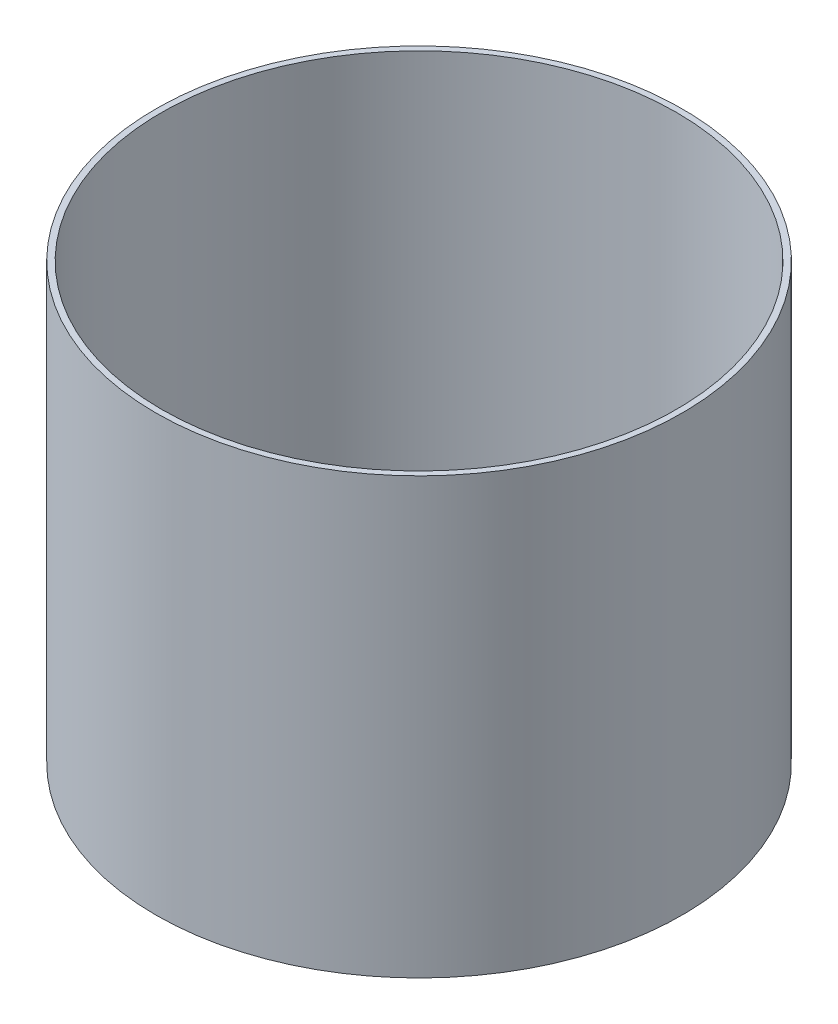
ISO-10303-21;
HEADER;
FILE_DESCRIPTION(('STEP AP214'),'2;1');
FILE_NAME('part.step','',(''),(''),'','','');
FILE_SCHEMA(('AUTOMOTIVE_DESIGN { 1 0 10303 214 1 1 1 1 }'));
ENDSEC;
DATA;
#1=APPLICATION_CONTEXT('core data for automotive mechanical design processes');
#2=APPLICATION_PROTOCOL_DEFINITION('international standard','automotive_design',2000,#1);
#3=PRODUCT_CONTEXT('',#1,'mechanical');
#4=PRODUCT('Part','Part','',(#3));
#5=PRODUCT_RELATED_PRODUCT_CATEGORY('part','',(#4));
#6=PRODUCT_DEFINITION_FORMATION('','',#4);
#7=PRODUCT_DEFINITION_CONTEXT('part definition',#1,'design');
#8=PRODUCT_DEFINITION('design','',#6,#7);
#9=PRODUCT_DEFINITION_SHAPE('','',#8);
#10=(LENGTH_UNIT() NAMED_UNIT(*) SI_UNIT(.MILLI.,.METRE.));
#11=(NAMED_UNIT(*) PLANE_ANGLE_UNIT() SI_UNIT($,.RADIAN.));
#12=(NAMED_UNIT(*) SI_UNIT($,.STERADIAN.) SOLID_ANGLE_UNIT());
#13=UNCERTAINTY_MEASURE_WITH_UNIT(LENGTH_MEASURE(1.E-05),#10,'distance_accuracy_value','');
#14=(GEOMETRIC_REPRESENTATION_CONTEXT(3) GLOBAL_UNCERTAINTY_ASSIGNED_CONTEXT((#13)) GLOBAL_UNIT_ASSIGNED_CONTEXT((#10,
#11,#12)) REPRESENTATION_CONTEXT('',''));
#15=CARTESIAN_POINT('',(0.,0.,0.));
#16=DIRECTION('',(0.,0.,1.));
#17=DIRECTION('',(1.,0.,0.));
#18=AXIS2_PLACEMENT_3D('',#15,#16,#17);
#19=CARTESIAN_POINT('',(0.,36.5,0.));
#20=DIRECTION('',(0.,1.,0.));
#21=DIRECTION('',(0.,0.,1.));
#22=AXIS2_PLACEMENT_3D('',#19,#20,#21);
#23=PLANE('',#22);
#24=CARTESIAN_POINT('',(0.,36.5,0.));
#25=DIRECTION('',(0.,1.,0.));
#26=DIRECTION('',(0.,0.,1.));
#27=AXIS2_PLACEMENT_3D('',#24,#25,#26);
#28=CIRCLE('',#27,22.1);
#29=CARTESIAN_POINT('',(0.,36.5,22.1));
#30=VERTEX_POINT('',#29);
#31=EDGE_CURVE('E10',#30,#30,#28,.T.);
#32=ORIENTED_EDGE('',*,*,#31,.T.);
#33=EDGE_LOOP('',(#32));
#34=FACE_BOUND('',#33,.T.);
#35=CARTESIAN_POINT('',(0.,36.5,0.));
#36=DIRECTION('',(0.,1.,0.));
#37=DIRECTION('',(0.,0.,1.));
#38=AXIS2_PLACEMENT_3D('',#35,#36,#37);
#39=CIRCLE('',#38,21.6);
#40=CARTESIAN_POINT('',(0.,36.5,21.6));
#41=VERTEX_POINT('',#40);
#42=EDGE_CURVE('E56',#41,#41,#39,.T.);
#43=ORIENTED_EDGE('',*,*,#42,.F.);
#44=EDGE_LOOP('',(#43));
#45=FACE_BOUND('',#44,.T.);
#46=ADVANCED_FACE('F41',(#34,#45),#23,.T.);
#47=CARTESIAN_POINT('',(0.,0.,0.));
#48=DIRECTION('',(0.,1.,0.));
#49=DIRECTION('',(0.,0.,1.));
#50=AXIS2_PLACEMENT_3D('',#47,#48,#49);
#51=PLANE('',#50);
#52=CARTESIAN_POINT('',(0.,0.,0.));
#53=DIRECTION('',(0.,1.,0.));
#54=DIRECTION('',(0.,0.,1.));
#55=AXIS2_PLACEMENT_3D('',#52,#53,#54);
#56=CIRCLE('',#55,22.1);
#57=CARTESIAN_POINT('',(0.,0.,22.1));
#58=VERTEX_POINT('',#57);
#59=EDGE_CURVE('E45',#58,#58,#56,.T.);
#60=ORIENTED_EDGE('',*,*,#59,.F.);
#61=EDGE_LOOP('',(#60));
#62=FACE_BOUND('',#61,.T.);
#63=CARTESIAN_POINT('',(0.,0.,0.));
#64=DIRECTION('',(0.,1.,0.));
#65=DIRECTION('',(0.,0.,1.));
#66=AXIS2_PLACEMENT_3D('',#63,#64,#65);
#67=CIRCLE('',#66,21.6);
#68=CARTESIAN_POINT('',(0.,0.,21.6));
#69=VERTEX_POINT('',#68);
#70=EDGE_CURVE('E58',#69,#69,#67,.T.);
#71=ORIENTED_EDGE('',*,*,#70,.T.);
#72=EDGE_LOOP('',(#71));
#73=FACE_BOUND('',#72,.T.);
#74=ADVANCED_FACE('F70',(#62,#73),#51,.F.);
#75=CARTESIAN_POINT('',(0.,36.5,0.));
#76=DIRECTION('',(0.,-1.,0.));
#77=DIRECTION('',(0.,0.,-1.));
#78=AXIS2_PLACEMENT_3D('',#75,#76,#77);
#79=CYLINDRICAL_SURFACE('',#78,22.1);
#80=ORIENTED_EDGE('',*,*,#31,.F.);
#81=EDGE_LOOP('',(#80));
#82=FACE_BOUND('',#81,.T.);
#83=ORIENTED_EDGE('',*,*,#59,.T.);
#84=EDGE_LOOP('',(#83));
#85=FACE_BOUND('',#84,.T.);
#86=ADVANCED_FACE('F43',(#82,#85),#79,.T.);
#87=CARTESIAN_POINT('',(0.,36.5,0.));
#88=DIRECTION('',(0.,-1.,0.));
#89=DIRECTION('',(0.,0.,-1.));
#90=AXIS2_PLACEMENT_3D('',#87,#88,#89);
#91=CYLINDRICAL_SURFACE('',#90,21.6);
#92=ORIENTED_EDGE('',*,*,#42,.T.);
#93=EDGE_LOOP('',(#92));
#94=FACE_BOUND('',#93,.T.);
#95=ORIENTED_EDGE('',*,*,#70,.F.);
#96=EDGE_LOOP('',(#95));
#97=FACE_BOUND('',#96,.T.);
#98=ADVANCED_FACE('F66',(#94,#97),#91,.F.);
#99=CLOSED_SHELL('',(#46,#74,#86,#98));
#100=MANIFOLD_SOLID_BREP('B2',#99);
#101=ADVANCED_BREP_SHAPE_REPRESENTATION('',(#18,#100),#14);
#102=SHAPE_DEFINITION_REPRESENTATION(#9,#101);
ENDSEC;
END-ISO-10303-21;
